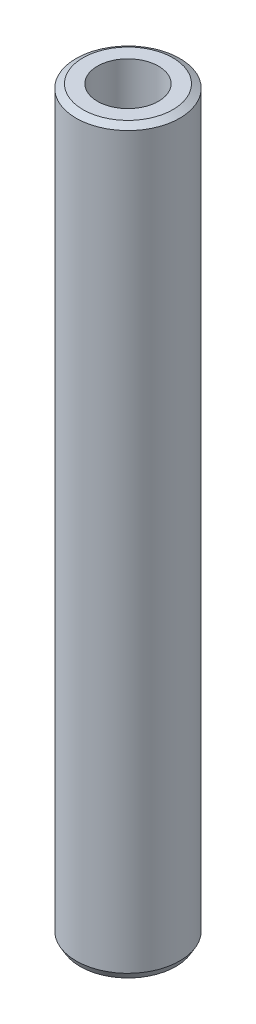
ISO-10303-21;
HEADER;
FILE_DESCRIPTION(('STEP AP214'),'2;1');
FILE_NAME('part.step','',(''),(''),'','','');
FILE_SCHEMA(('AUTOMOTIVE_DESIGN { 1 0 10303 214 1 1 1 1 }'));
ENDSEC;
DATA;
#1=APPLICATION_CONTEXT('core data for automotive mechanical design processes');
#2=APPLICATION_PROTOCOL_DEFINITION('international standard','automotive_design',2000,#1);
#3=PRODUCT_CONTEXT('',#1,'mechanical');
#4=PRODUCT('Part','Part','',(#3));
#5=PRODUCT_RELATED_PRODUCT_CATEGORY('part','',(#4));
#6=PRODUCT_DEFINITION_FORMATION('','',#4);
#7=PRODUCT_DEFINITION_CONTEXT('part definition',#1,'design');
#8=PRODUCT_DEFINITION('design','',#6,#7);
#9=PRODUCT_DEFINITION_SHAPE('','',#8);
#10=(LENGTH_UNIT() NAMED_UNIT(*) SI_UNIT(.MILLI.,.METRE.));
#11=(NAMED_UNIT(*) PLANE_ANGLE_UNIT() SI_UNIT($,.RADIAN.));
#12=(NAMED_UNIT(*) SI_UNIT($,.STERADIAN.) SOLID_ANGLE_UNIT());
#13=UNCERTAINTY_MEASURE_WITH_UNIT(LENGTH_MEASURE(1.E-05),#10,'distance_accuracy_value','');
#14=(GEOMETRIC_REPRESENTATION_CONTEXT(3) GLOBAL_UNCERTAINTY_ASSIGNED_CONTEXT((#13)) GLOBAL_UNIT_ASSIGNED_CONTEXT((#10,
#11,#12)) REPRESENTATION_CONTEXT('',''));
#15=CARTESIAN_POINT('',(0.,0.,0.));
#16=DIRECTION('',(0.,0.,1.));
#17=DIRECTION('',(1.,0.,0.));
#18=AXIS2_PLACEMENT_3D('',#15,#16,#17);
#19=CARTESIAN_POINT('',(0.,393.137035878981,0.));
#20=DIRECTION('',(0.,-1.,0.));
#21=DIRECTION('',(0.,0.,-1.));
#22=AXIS2_PLACEMENT_3D('',#19,#20,#21);
#23=CYLINDRICAL_SURFACE('',#22,27.5);
#24=CARTESIAN_POINT('',(0.,391.03187186431,0.));
#25=DIRECTION('',(0.,1.,0.));
#26=DIRECTION('',(0.,0.,1.));
#27=AXIS2_PLACEMENT_3D('',#24,#25,#26);
#28=CIRCLE('',#27,27.5);
#29=CARTESIAN_POINT('',(0.,391.03187186431,27.5));
#30=VERTEX_POINT('',#29);
#31=EDGE_CURVE('E50',#30,#30,#28,.F.);
#32=ORIENTED_EDGE('',*,*,#31,.T.);
#33=EDGE_LOOP('',(#32));
#34=FACE_BOUND('',#33,.T.);
#35=CARTESIAN_POINT('',(0.,3.64625103167537,0.));
#36=DIRECTION('',(0.,1.,0.));
#37=DIRECTION('',(0.,0.,1.));
#38=AXIS2_PLACEMENT_3D('',#35,#36,#37);
#39=CIRCLE('',#38,27.5);
#40=CARTESIAN_POINT('',(0.,3.64625103167537,27.5));
#41=VERTEX_POINT('',#40);
#42=EDGE_CURVE('E51',#41,#41,#39,.T.);
#43=ORIENTED_EDGE('',*,*,#42,.T.);
#44=EDGE_LOOP('',(#43));
#45=FACE_BOUND('',#44,.T.);
#46=ADVANCED_FACE('F39',(#34,#45),#23,.T.);
#47=CARTESIAN_POINT('',(0.,393.137035878981,0.));
#48=DIRECTION('',(0.,1.,0.));
#49=DIRECTION('',(0.,0.,1.));
#50=AXIS2_PLACEMENT_3D('',#47,#48,#49);
#51=PLANE('',#50);
#52=CARTESIAN_POINT('',(0.,393.137035878981,0.));
#53=DIRECTION('',(0.,1.,0.));
#54=DIRECTION('',(0.,0.,1.));
#55=AXIS2_PLACEMENT_3D('',#52,#53,#54);
#56=CIRCLE('',#55,23.8537489683245);
#57=CARTESIAN_POINT('',(0.,393.137035878981,23.8537489683245));
#58=VERTEX_POINT('',#57);
#59=EDGE_CURVE('E54',#58,#58,#56,.T.);
#60=ORIENTED_EDGE('',*,*,#59,.T.);
#61=EDGE_LOOP('',(#60));
#62=FACE_BOUND('',#61,.T.);
#63=CARTESIAN_POINT('',(0.,393.137035878981,0.));
#64=DIRECTION('',(0.,1.,0.));
#65=DIRECTION('',(0.,0.,1.));
#66=AXIS2_PLACEMENT_3D('',#63,#64,#65);
#67=CIRCLE('',#66,16.2015076723933);
#68=CARTESIAN_POINT('',(0.,393.137035878981,16.2015076723933));
#69=VERTEX_POINT('',#68);
#70=EDGE_CURVE('E58',#69,#69,#67,.T.);
#71=ORIENTED_EDGE('',*,*,#70,.F.);
#72=EDGE_LOOP('',(#71));
#73=FACE_BOUND('',#72,.T.);
#74=ADVANCED_FACE('F69',(#62,#73),#51,.T.);
#75=CARTESIAN_POINT('',(0.,0.,0.));
#76=DIRECTION('',(0.,1.,0.));
#77=DIRECTION('',(0.,0.,1.));
#78=AXIS2_PLACEMENT_3D('',#75,#76,#77);
#79=PLANE('',#78);
#80=CARTESIAN_POINT('',(0.,0.,0.));
#81=DIRECTION('',(0.,1.,0.));
#82=DIRECTION('',(0.,0.,1.));
#83=AXIS2_PLACEMENT_3D('',#80,#81,#82);
#84=CIRCLE('',#83,25.3948359853293);
#85=CARTESIAN_POINT('',(0.,0.,25.3948359853293));
#86=VERTEX_POINT('',#85);
#87=EDGE_CURVE('E10',#86,#86,#84,.F.);
#88=ORIENTED_EDGE('',*,*,#87,.T.);
#89=EDGE_LOOP('',(#88));
#90=FACE_BOUND('',#89,.T.);
#91=CARTESIAN_POINT('',(0.,0.,0.));
#92=DIRECTION('',(0.,1.,0.));
#93=DIRECTION('',(0.,0.,1.));
#94=AXIS2_PLACEMENT_3D('',#91,#92,#93);
#95=CIRCLE('',#94,16.2015076723933);
#96=CARTESIAN_POINT('',(0.,0.,16.2015076723933));
#97=VERTEX_POINT('',#96);
#98=EDGE_CURVE('E63',#97,#97,#95,.T.);
#99=ORIENTED_EDGE('',*,*,#98,.T.);
#100=EDGE_LOOP('',(#99));
#101=FACE_BOUND('',#100,.T.);
#102=ADVANCED_FACE('F75',(#90,#101),#79,.F.);
#103=CARTESIAN_POINT('',(0.,393.137035878981,0.));
#104=DIRECTION('',(0.,-1.,0.));
#105=DIRECTION('',(0.,0.,-1.));
#106=AXIS2_PLACEMENT_3D('',#103,#104,#105);
#107=CYLINDRICAL_SURFACE('',#106,16.2015076723933);
#108=ORIENTED_EDGE('',*,*,#70,.T.);
#109=EDGE_LOOP('',(#108));
#110=FACE_BOUND('',#109,.T.);
#111=ORIENTED_EDGE('',*,*,#98,.F.);
#112=EDGE_LOOP('',(#111));
#113=FACE_BOUND('',#112,.T.);
#114=ADVANCED_FACE('F70',(#110,#113),#107,.F.);
#115=CARTESIAN_POINT('',(0.,393.137035878981,0.));
#116=DIRECTION('',(0.,-1.,0.));
#117=DIRECTION('',(0.,0.,-1.));
#118=AXIS2_PLACEMENT_3D('',#115,#116,#117);
#119=CONICAL_SURFACE('',#118,23.8537489683245,1.0471975511966);
#120=ORIENTED_EDGE('',*,*,#31,.F.);
#121=EDGE_LOOP('',(#120));
#122=FACE_BOUND('',#121,.T.);
#123=ORIENTED_EDGE('',*,*,#59,.F.);
#124=EDGE_LOOP('',(#123));
#125=FACE_BOUND('',#124,.T.);
#126=ADVANCED_FACE('F81',(#122,#125),#119,.T.);
#127=CARTESIAN_POINT('',(0.,3.64625103167537,0.));
#128=DIRECTION('',(0.,1.,0.));
#129=DIRECTION('',(0.,0.,1.));
#130=AXIS2_PLACEMENT_3D('',#127,#128,#129);
#131=CONICAL_SURFACE('',#130,27.5,0.523598775598301);
#132=CARTESIAN_POINT('',(0.,0.,25.3948359853293));
#133=CARTESIAN_POINT('',(0.,0.0379817815799517,25.4167647771488));
#134=CARTESIAN_POINT('',(0.,0.0759635631599034,25.4386935689682));
#135=CARTESIAN_POINT('',(0.,0.151927126319807,25.4825511526072));
#136=CARTESIAN_POINT('',(0.,0.189908907899758,25.5044799444267));
#137=CARTESIAN_POINT('',(0.,0.265872471059662,25.5483375280657));
#138=CARTESIAN_POINT('',(0.,0.303854252639614,25.5702663198852));
#139=CARTESIAN_POINT('',(0.,0.379817815799518,25.6141239035241));
#140=CARTESIAN_POINT('',(0.,0.41779959737947,25.6360526953436));
#141=CARTESIAN_POINT('',(0.,0.493763160539373,25.6799102789826));
#142=CARTESIAN_POINT('',(0.,0.531744942119325,25.7018390708021));
#143=CARTESIAN_POINT('',(0.,0.607708505279229,25.7456966544411));
#144=CARTESIAN_POINT('',(0.,0.645690286859181,25.7676254462605));
#145=CARTESIAN_POINT('',(0.,0.721653850019084,25.8114830298995));
#146=CARTESIAN_POINT('',(0.,0.759635631599035,25.833411821719));
#147=CARTESIAN_POINT('',(0.,0.835599194758939,25.877269405358));
#148=CARTESIAN_POINT('',(0.,0.873580976338891,25.8991981971775));
#149=CARTESIAN_POINT('',(0.,0.949544539498795,25.9430557808164));
#150=CARTESIAN_POINT('',(0.,0.987526321078747,25.9649845726359));
#151=CARTESIAN_POINT('',(0.,1.06348988423865,26.0088421562749));
#152=CARTESIAN_POINT('',(0.,1.1014716658186,26.0307709480944));
#153=CARTESIAN_POINT('',(0.,1.17743522897851,26.0746285317334));
#154=CARTESIAN_POINT('',(0.,1.21541701055846,26.0965573235528));
#155=CARTESIAN_POINT('',(0.,1.29138057371836,26.1404149071918));
#156=CARTESIAN_POINT('',(0.,1.32936235529831,26.1623436990113));
#157=CARTESIAN_POINT('',(0.,1.40532591845822,26.2062012826503));
#158=CARTESIAN_POINT('',(0.,1.44330770003817,26.2281300744698));
#159=CARTESIAN_POINT('',(0.,1.51927126319807,26.2719876581087));
#160=CARTESIAN_POINT('',(0.,1.55725304477802,26.2939164499282));
#161=CARTESIAN_POINT('',(0.,1.63321660793793,26.3377740335672));
#162=CARTESIAN_POINT('',(0.,1.67119838951788,26.3597028253867));
#163=CARTESIAN_POINT('',(0.,1.74716195267778,26.4035604090257));
#164=CARTESIAN_POINT('',(0.,1.78514373425773,26.4254892008451));
#165=CARTESIAN_POINT('',(0.,1.86110729741764,26.4693467844841));
#166=CARTESIAN_POINT('',(0.,1.89908907899759,26.4912755763036));
#167=CARTESIAN_POINT('',(0.,1.97505264215749,26.5351331599426));
#168=CARTESIAN_POINT('',(0.,2.01303442373745,26.5570619517621));
#169=CARTESIAN_POINT('',(0.,2.08899798689735,26.600919535401));
#170=CARTESIAN_POINT('',(0.,2.1269797684773,26.6228483272205));
#171=CARTESIAN_POINT('',(0.,2.20294333163721,26.6667059108595));
#172=CARTESIAN_POINT('',(0.,2.24092511321716,26.688634702679));
#173=CARTESIAN_POINT('',(0.,2.31688867637706,26.732492286318));
#174=CARTESIAN_POINT('',(0.,2.35487045795701,26.7544210781375));
#175=CARTESIAN_POINT('',(0.,2.43083402111692,26.7982786617764));
#176=CARTESIAN_POINT('',(0.,2.46881580269687,26.8202074535959));
#177=CARTESIAN_POINT('',(0.,2.54477936585677,26.8640650372349));
#178=CARTESIAN_POINT('',(0.,2.58276114743672,26.8859938290544));
#179=CARTESIAN_POINT('',(0.,2.65872471059663,26.9298514126933));
#180=CARTESIAN_POINT('',(0.,2.69670649217658,26.9517802045128));
#181=CARTESIAN_POINT('',(0.,2.77267005533648,26.9956377881518));
#182=CARTESIAN_POINT('',(0.,2.81065183691643,27.0175665799713));
#183=CARTESIAN_POINT('',(0.,2.88661540007634,27.0614241636103));
#184=CARTESIAN_POINT('',(0.,2.92459718165629,27.0833529554298));
#185=CARTESIAN_POINT('',(0.,3.00056074481619,27.1272105390687));
#186=CARTESIAN_POINT('',(0.,3.03854252639614,27.1491393308882));
#187=CARTESIAN_POINT('',(0.,3.11450608955605,27.1929969145272));
#188=CARTESIAN_POINT('',(0.,3.152487871136,27.2149257063467));
#189=CARTESIAN_POINT('',(0.,3.2284514342959,27.2587832899856));
#190=CARTESIAN_POINT('',(0.,3.26643321587586,27.2807120818051));
#191=CARTESIAN_POINT('',(0.,3.34239677903576,27.3245696654441));
#192=CARTESIAN_POINT('',(0.,3.38037856061571,27.3464984572636));
#193=CARTESIAN_POINT('',(0.,3.45634212377561,27.3903560409026));
#194=CARTESIAN_POINT('',(0.,3.49432390535557,27.4122848327221));
#195=CARTESIAN_POINT('',(0.,3.57028746851547,27.456142416361));
#196=CARTESIAN_POINT('',(0.,3.60826925009542,27.4780712081805));
#197=CARTESIAN_POINT('',(0.,3.64625103167537,27.5));
#198=B_SPLINE_CURVE_WITH_KNOTS('',3,(#132,#133,#134,#135,#136,#137,#138,#139,#140,#141,#142,
#143,#144,#145,#146,#147,#148,#149,#150,#151,#152,#153,#154,#155,#156,#157,#158,#159,#160,#161,
#162,#163,#164,#165,#166,#167,#168,#169,#170,#171,#172,#173,#174,#175,#176,#177,#178,#179,#180,
#181,#182,#183,#184,#185,#186,#187,#188,#189,#190,#191,#192,#193,#194,#195,#196,#197),
.UNSPECIFIED.,.F.,.F.,(4,2,2,2,2,2,2,2,2,2,2,2,2,2,2,2,2,2,2,2,2,2,2,2,2,2,2,2,2,2,2,2,4),(0.,
0.131572750916921,0.263145501833842,0.394718252750761,0.526291003667682,0.657863754584603,
0.789436505501524,0.921009256418445,1.05258200733536,1.18415475825229,1.31572750916921,
1.44730026008613,1.57887301100305,1.71044576191997,1.84201851283689,1.97359126375381,
2.10516401467073,2.23673676558765,2.36830951650457,2.49988226742149,2.63145501833841,
2.76302776925533,2.89460052017226,3.02617327108918,3.1577460220061,3.28931877292302,
3.42089152383994,3.55246427475686,3.68403702567378,3.8156097765907,3.94718252750762,
4.07875527842454,4.21032802934146),.UNSPECIFIED.);
#199=EDGE_CURVE('BSEAM45',#86,#41,#198,.T.);
#200=ORIENTED_EDGE('',*,*,#87,.F.);
#201=ORIENTED_EDGE('',*,*,#42,.F.);
#202=ORIENTED_EDGE('',*,*,#199,.T.);
#203=ORIENTED_EDGE('',*,*,#199,.F.);
#204=EDGE_LOOP('',(#200,#202,#201,#203));
#205=FACE_BOUND('',#204,.T.);
#206=ADVANCED_FACE('F45',(#205),#131,.T.);
#207=CLOSED_SHELL('',(#46,#74,#102,#114,#126,#206));
#208=MANIFOLD_SOLID_BREP('B2',#207);
#209=ADVANCED_BREP_SHAPE_REPRESENTATION('',(#18,#208),#14);
#210=SHAPE_DEFINITION_REPRESENTATION(#9,#209);
ENDSEC;
END-ISO-10303-21;
